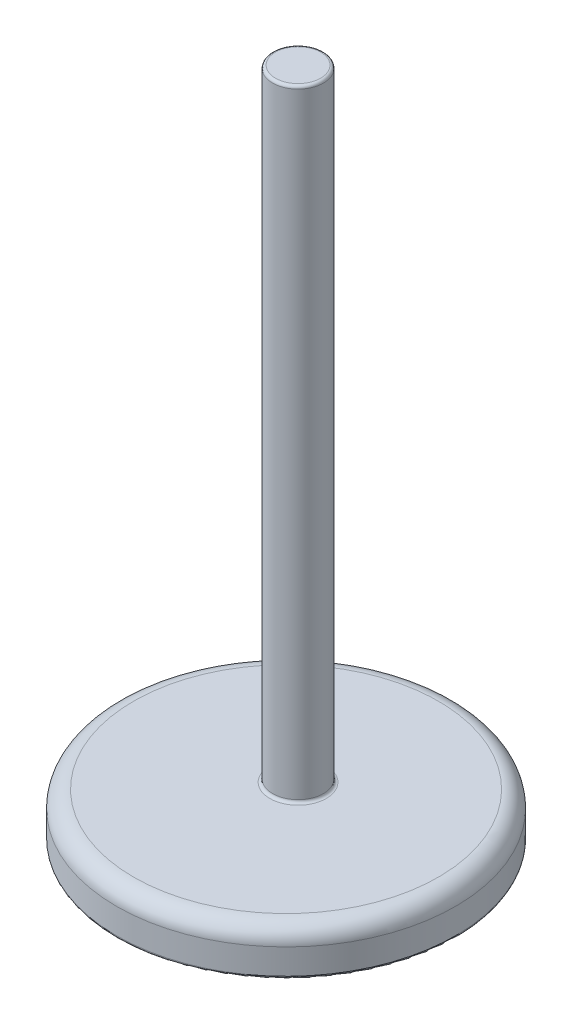
ISO-10303-21;
HEADER;
FILE_DESCRIPTION(('STEP AP214'),'2;1');
FILE_NAME('part.step','',(''),(''),'','','');
FILE_SCHEMA(('AUTOMOTIVE_DESIGN { 1 0 10303 214 1 1 1 1 }'));
ENDSEC;
DATA;
#1=APPLICATION_CONTEXT('core data for automotive mechanical design processes');
#2=APPLICATION_PROTOCOL_DEFINITION('international standard','automotive_design',2000,#1);
#3=PRODUCT_CONTEXT('',#1,'mechanical');
#4=PRODUCT('Part','Part','',(#3));
#5=PRODUCT_RELATED_PRODUCT_CATEGORY('part','',(#4));
#6=PRODUCT_DEFINITION_FORMATION('','',#4);
#7=PRODUCT_DEFINITION_CONTEXT('part definition',#1,'design');
#8=PRODUCT_DEFINITION('design','',#6,#7);
#9=PRODUCT_DEFINITION_SHAPE('','',#8);
#10=(LENGTH_UNIT() NAMED_UNIT(*) SI_UNIT(.MILLI.,.METRE.));
#11=(NAMED_UNIT(*) PLANE_ANGLE_UNIT() SI_UNIT($,.RADIAN.));
#12=(NAMED_UNIT(*) SI_UNIT($,.STERADIAN.) SOLID_ANGLE_UNIT());
#13=UNCERTAINTY_MEASURE_WITH_UNIT(LENGTH_MEASURE(1.E-05),#10,'distance_accuracy_value','');
#14=(GEOMETRIC_REPRESENTATION_CONTEXT(3) GLOBAL_UNCERTAINTY_ASSIGNED_CONTEXT((#13)) GLOBAL_UNIT_ASSIGNED_CONTEXT((#10,
#11,#12)) REPRESENTATION_CONTEXT('',''));
#15=CARTESIAN_POINT('',(0.,0.,0.));
#16=DIRECTION('',(0.,0.,1.));
#17=DIRECTION('',(1.,0.,0.));
#18=AXIS2_PLACEMENT_3D('',#15,#16,#17);
#19=CARTESIAN_POINT('',(0.,16.,0.));
#20=DIRECTION('',(0.,-1.,0.));
#21=DIRECTION('',(0.,0.,-1.));
#22=AXIS2_PLACEMENT_3D('',#19,#20,#21);
#23=CYLINDRICAL_SURFACE('',#22,60.);
#24=CARTESIAN_POINT('',(0.,1.,0.));
#25=DIRECTION('',(0.,1.,0.));
#26=DIRECTION('',(0.,0.,1.));
#27=AXIS2_PLACEMENT_3D('',#24,#25,#26);
#28=CIRCLE('',#27,60.);
#29=CARTESIAN_POINT('',(0.,1.,60.));
#30=VERTEX_POINT('',#29);
#31=EDGE_CURVE('E49',#30,#30,#28,.T.);
#32=ORIENTED_EDGE('',*,*,#31,.T.);
#33=EDGE_LOOP('',(#32));
#34=FACE_BOUND('',#33,.T.);
#35=CARTESIAN_POINT('',(0.,10.,0.));
#36=DIRECTION('',(0.,1.,0.));
#37=DIRECTION('',(0.,0.,1.));
#38=AXIS2_PLACEMENT_3D('',#35,#36,#37);
#39=CIRCLE('',#38,60.);
#40=CARTESIAN_POINT('',(0.,10.,60.));
#41=VERTEX_POINT('',#40);
#42=EDGE_CURVE('E73',#41,#41,#39,.F.);
#43=ORIENTED_EDGE('',*,*,#42,.T.);
#44=EDGE_LOOP('',(#43));
#45=FACE_BOUND('',#44,.T.);
#46=ADVANCED_FACE('F41',(#34,#45),#23,.T.);
#47=CARTESIAN_POINT('',(0.,16.,0.));
#48=DIRECTION('',(0.,1.,0.));
#49=DIRECTION('',(0.,0.,1.));
#50=AXIS2_PLACEMENT_3D('',#47,#48,#49);
#51=PLANE('',#50);
#52=CARTESIAN_POINT('',(0.,16.,-4.25329828237864));
#53=DIRECTION('',(0.,1.,0.));
#54=DIRECTION('',(0.,0.,1.));
#55=AXIS2_PLACEMENT_3D('',#52,#53,#54);
#56=CIRCLE('',#55,10.);
#57=CARTESIAN_POINT('',(0.,16.,5.74670171762136));
#58=VERTEX_POINT('',#57);
#59=EDGE_CURVE('E59',#58,#58,#56,.F.);
#60=ORIENTED_EDGE('',*,*,#59,.T.);
#61=EDGE_LOOP('',(#60));
#62=FACE_BOUND('',#61,.T.);
#63=CARTESIAN_POINT('',(0.,16.,0.));
#64=DIRECTION('',(0.,1.,0.));
#65=DIRECTION('',(0.,0.,1.));
#66=AXIS2_PLACEMENT_3D('',#63,#64,#65);
#67=CIRCLE('',#66,54.);
#68=CARTESIAN_POINT('',(0.,16.,54.));
#69=VERTEX_POINT('',#68);
#70=EDGE_CURVE('E77',#69,#69,#67,.T.);
#71=ORIENTED_EDGE('',*,*,#70,.T.);
#72=EDGE_LOOP('',(#71));
#73=FACE_BOUND('',#72,.T.);
#74=ADVANCED_FACE('F82',(#62,#73),#51,.T.);
#75=CARTESIAN_POINT('',(0.,0.,0.));
#76=DIRECTION('',(0.,1.,0.));
#77=DIRECTION('',(0.,0.,1.));
#78=AXIS2_PLACEMENT_3D('',#75,#76,#77);
#79=PLANE('',#78);
#80=CARTESIAN_POINT('',(0.,0.,0.));
#81=DIRECTION('',(0.,1.,0.));
#82=DIRECTION('',(0.,0.,1.));
#83=AXIS2_PLACEMENT_3D('',#80,#81,#82);
#84=CIRCLE('',#83,59.);
#85=CARTESIAN_POINT('',(0.,0.,59.));
#86=VERTEX_POINT('',#85);
#87=EDGE_CURVE('E10',#86,#86,#84,.F.);
#88=ORIENTED_EDGE('',*,*,#87,.T.);
#89=EDGE_LOOP('',(#88));
#90=FACE_BOUND('',#89,.T.);
#91=ADVANCED_FACE('F106',(#90),#79,.F.);
#92=CARTESIAN_POINT('',(0.,236.,-4.25329828237864));
#93=DIRECTION('',(0.,-1.,0.));
#94=DIRECTION('',(0.,0.,-1.));
#95=AXIS2_PLACEMENT_3D('',#92,#93,#94);
#96=CYLINDRICAL_SURFACE('',#95,9.);
#97=CARTESIAN_POINT('',(0.,17.,-4.25329828237864));
#98=DIRECTION('',(0.,1.,0.));
#99=DIRECTION('',(0.,0.,1.));
#100=AXIS2_PLACEMENT_3D('',#97,#98,#99);
#101=CIRCLE('',#100,9.);
#102=CARTESIAN_POINT('',(0.,17.,4.74670171762136));
#103=VERTEX_POINT('',#102);
#104=EDGE_CURVE('E65',#103,#103,#101,.T.);
#105=ORIENTED_EDGE('',*,*,#104,.T.);
#106=EDGE_LOOP('',(#105));
#107=FACE_BOUND('',#106,.T.);
#108=CARTESIAN_POINT('',(0.,235.,-4.25329828237864));
#109=DIRECTION('',(0.,1.,0.));
#110=DIRECTION('',(0.,0.,1.));
#111=AXIS2_PLACEMENT_3D('',#108,#109,#110);
#112=CIRCLE('',#111,9.);
#113=CARTESIAN_POINT('',(0.,235.,4.74670171762136));
#114=VERTEX_POINT('',#113);
#115=EDGE_CURVE('E69',#114,#114,#112,.F.);
#116=ORIENTED_EDGE('',*,*,#115,.T.);
#117=EDGE_LOOP('',(#116));
#118=FACE_BOUND('',#117,.T.);
#119=ADVANCED_FACE('F97',(#107,#118),#96,.T.);
#120=CARTESIAN_POINT('',(0.,236.,-4.25329828237864));
#121=DIRECTION('',(0.,1.,0.));
#122=DIRECTION('',(0.,0.,1.));
#123=AXIS2_PLACEMENT_3D('',#120,#121,#122);
#124=PLANE('',#123);
#125=CARTESIAN_POINT('',(0.,236.,-4.25329828237864));
#126=DIRECTION('',(0.,1.,0.));
#127=DIRECTION('',(0.,0.,1.));
#128=AXIS2_PLACEMENT_3D('',#125,#126,#127);
#129=CIRCLE('',#128,8.);
#130=CARTESIAN_POINT('',(0.,236.,3.74670171762136));
#131=VERTEX_POINT('',#130);
#132=EDGE_CURVE('E54',#131,#131,#129,.T.);
#133=ORIENTED_EDGE('',*,*,#132,.T.);
#134=EDGE_LOOP('',(#133));
#135=FACE_BOUND('',#134,.T.);
#136=ADVANCED_FACE('F87',(#135),#124,.T.);
#137=CARTESIAN_POINT('',(0.,10.,0.));
#138=DIRECTION('',(0.,1.,0.));
#139=DIRECTION('',(0.,0.,1.));
#140=AXIS2_PLACEMENT_3D('',#137,#138,#139);
#141=TOROIDAL_SURFACE('',#140,54.,6.);
#142=ORIENTED_EDGE('',*,*,#42,.F.);
#143=EDGE_LOOP('',(#142));
#144=FACE_BOUND('',#143,.T.);
#145=ORIENTED_EDGE('',*,*,#70,.F.);
#146=EDGE_LOOP('',(#145));
#147=FACE_BOUND('',#146,.T.);
#148=ADVANCED_FACE('F84',(#144,#147),#141,.T.);
#149=CARTESIAN_POINT('',(0.,17.,-4.25329828237864));
#150=DIRECTION('',(0.,1.,0.));
#151=DIRECTION('',(0.,0.,1.));
#152=AXIS2_PLACEMENT_3D('',#149,#150,#151);
#153=TOROIDAL_SURFACE('',#152,10.,1.);
#154=ORIENTED_EDGE('',*,*,#59,.F.);
#155=EDGE_LOOP('',(#154));
#156=FACE_BOUND('',#155,.T.);
#157=ORIENTED_EDGE('',*,*,#104,.F.);
#158=EDGE_LOOP('',(#157));
#159=FACE_BOUND('',#158,.T.);
#160=ADVANCED_FACE('F86',(#156,#159),#153,.F.);
#161=CARTESIAN_POINT('',(0.,235.,-4.25329828237864));
#162=DIRECTION('',(0.,1.,0.));
#163=DIRECTION('',(0.,0.,1.));
#164=AXIS2_PLACEMENT_3D('',#161,#162,#163);
#165=TOROIDAL_SURFACE('',#164,8.,1.);
#166=ORIENTED_EDGE('',*,*,#115,.F.);
#167=EDGE_LOOP('',(#166));
#168=FACE_BOUND('',#167,.T.);
#169=ORIENTED_EDGE('',*,*,#132,.F.);
#170=EDGE_LOOP('',(#169));
#171=FACE_BOUND('',#170,.T.);
#172=ADVANCED_FACE('F94',(#168,#171),#165,.T.);
#173=CARTESIAN_POINT('',(0.,1.,0.));
#174=DIRECTION('',(0.,1.,0.));
#175=DIRECTION('',(0.,0.,1.));
#176=AXIS2_PLACEMENT_3D('',#173,#174,#175);
#177=TOROIDAL_SURFACE('',#176,59.,1.);
#178=ORIENTED_EDGE('',*,*,#87,.F.);
#179=EDGE_LOOP('',(#178));
#180=FACE_BOUND('',#179,.T.);
#181=ORIENTED_EDGE('',*,*,#31,.F.);
#182=EDGE_LOOP('',(#181));
#183=FACE_BOUND('',#182,.T.);
#184=ADVANCED_FACE('F43',(#180,#183),#177,.T.);
#185=CLOSED_SHELL('',(#46,#74,#91,#119,#136,#148,#160,#172,#184));
#186=MANIFOLD_SOLID_BREP('B2',#185);
#187=ADVANCED_BREP_SHAPE_REPRESENTATION('',(#18,#186),#14);
#188=SHAPE_DEFINITION_REPRESENTATION(#9,#187);
ENDSEC;
END-ISO-10303-21;
